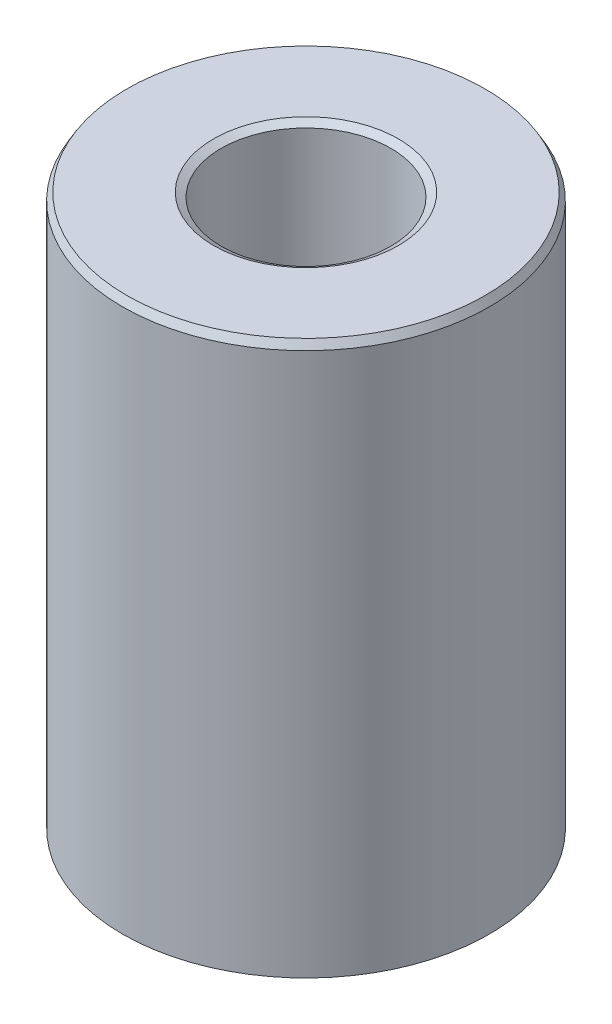
ISO-10303-21;
HEADER;
FILE_DESCRIPTION(('STEP AP214'),'2;1');
FILE_NAME('part.step','',(''),(''),'','','');
FILE_SCHEMA(('AUTOMOTIVE_DESIGN { 1 0 10303 214 1 1 1 1 }'));
ENDSEC;
DATA;
#1=APPLICATION_CONTEXT('core data for automotive mechanical design processes');
#2=APPLICATION_PROTOCOL_DEFINITION('international standard','automotive_design',2000,#1);
#3=PRODUCT_CONTEXT('',#1,'mechanical');
#4=PRODUCT('Part','Part','',(#3));
#5=PRODUCT_RELATED_PRODUCT_CATEGORY('part','',(#4));
#6=PRODUCT_DEFINITION_FORMATION('','',#4);
#7=PRODUCT_DEFINITION_CONTEXT('part definition',#1,'design');
#8=PRODUCT_DEFINITION('design','',#6,#7);
#9=PRODUCT_DEFINITION_SHAPE('','',#8);
#10=(LENGTH_UNIT() NAMED_UNIT(*) SI_UNIT(.MILLI.,.METRE.));
#11=(NAMED_UNIT(*) PLANE_ANGLE_UNIT() SI_UNIT($,.RADIAN.));
#12=(NAMED_UNIT(*) SI_UNIT($,.STERADIAN.) SOLID_ANGLE_UNIT());
#13=UNCERTAINTY_MEASURE_WITH_UNIT(LENGTH_MEASURE(1.E-05),#10,'distance_accuracy_value','');
#14=(GEOMETRIC_REPRESENTATION_CONTEXT(3) GLOBAL_UNCERTAINTY_ASSIGNED_CONTEXT((#13)) GLOBAL_UNIT_ASSIGNED_CONTEXT((#10,
#11,#12)) REPRESENTATION_CONTEXT('',''));
#15=CARTESIAN_POINT('',(0.,0.,0.));
#16=DIRECTION('',(0.,0.,1.));
#17=DIRECTION('',(1.,0.,0.));
#18=AXIS2_PLACEMENT_3D('',#15,#16,#17);
#19=CARTESIAN_POINT('',(0.,37.8354543892227,0.));
#20=DIRECTION('',(0.,-1.,0.));
#21=DIRECTION('',(0.,0.,-1.));
#22=AXIS2_PLACEMENT_3D('',#19,#20,#21);
#23=CYLINDRICAL_SURFACE('',#22,12.5);
#24=CARTESIAN_POINT('',(0.,0.298097300697332,0.));
#25=DIRECTION('',(0.,1.,0.));
#26=DIRECTION('',(0.,0.,1.));
#27=AXIS2_PLACEMENT_3D('',#24,#25,#26);
#28=CIRCLE('',#27,12.5);
#29=CARTESIAN_POINT('',(0.,0.298097300697332,12.5));
#30=VERTEX_POINT('',#29);
#31=EDGE_CURVE('E10',#30,#30,#28,.T.);
#32=ORIENTED_EDGE('',*,*,#31,.T.);
#33=EDGE_LOOP('',(#32));
#34=FACE_BOUND('',#33,.T.);
#35=CARTESIAN_POINT('',(0.,37.3191347188158,0.));
#36=DIRECTION('',(0.,1.,0.));
#37=DIRECTION('',(0.,0.,1.));
#38=AXIS2_PLACEMENT_3D('',#35,#36,#37);
#39=CIRCLE('',#38,12.5);
#40=CARTESIAN_POINT('',(0.,37.3191347188158,12.5));
#41=VERTEX_POINT('',#40);
#42=EDGE_CURVE('E50',#41,#41,#39,.F.);
#43=ORIENTED_EDGE('',*,*,#42,.T.);
#44=EDGE_LOOP('',(#43));
#45=FACE_BOUND('',#44,.T.);
#46=ADVANCED_FACE('F39',(#34,#45),#23,.T.);
#47=CARTESIAN_POINT('',(0.,37.8354543892227,0.));
#48=DIRECTION('',(0.,1.,0.));
#49=DIRECTION('',(0.,0.,1.));
#50=AXIS2_PLACEMENT_3D('',#47,#48,#49);
#51=PLANE('',#50);
#52=CARTESIAN_POINT('',(0.,37.8354543892227,0.));
#53=DIRECTION('',(0.,1.,0.));
#54=DIRECTION('',(0.,0.,1.));
#55=AXIS2_PLACEMENT_3D('',#52,#53,#54);
#56=CIRCLE('',#55,6.30006058035983);
#57=CARTESIAN_POINT('',(0.,37.8354543892227,6.30006058035983));
#58=VERTEX_POINT('',#57);
#59=EDGE_CURVE('E58',#58,#58,#56,.F.);
#60=ORIENTED_EDGE('',*,*,#59,.T.);
#61=EDGE_LOOP('',(#60));
#62=FACE_BOUND('',#61,.T.);
#63=CARTESIAN_POINT('',(0.,37.8354543892227,0.));
#64=DIRECTION('',(0.,1.,0.));
#65=DIRECTION('',(0.,0.,1.));
#66=AXIS2_PLACEMENT_3D('',#63,#64,#65);
#67=CIRCLE('',#66,12.2019026993027);
#68=CARTESIAN_POINT('',(0.,37.8354543892227,12.2019026993027));
#69=VERTEX_POINT('',#68);
#70=EDGE_CURVE('E61',#69,#69,#67,.T.);
#71=ORIENTED_EDGE('',*,*,#70,.T.);
#72=EDGE_LOOP('',(#71));
#73=FACE_BOUND('',#72,.T.);
#74=ADVANCED_FACE('F88',(#62,#73),#51,.T.);
#75=CARTESIAN_POINT('',(0.,0.,0.));
#76=DIRECTION('',(0.,1.,0.));
#77=DIRECTION('',(0.,0.,1.));
#78=AXIS2_PLACEMENT_3D('',#75,#76,#77);
#79=PLANE('',#78);
#80=CARTESIAN_POINT('',(0.,0.,0.));
#81=DIRECTION('',(0.,1.,0.));
#82=DIRECTION('',(0.,0.,1.));
#83=AXIS2_PLACEMENT_3D('',#80,#81,#82);
#84=CIRCLE('',#83,6.08183821065023);
#85=CARTESIAN_POINT('',(0.,0.,6.08183821065023));
#86=VERTEX_POINT('',#85);
#87=EDGE_CURVE('E51',#86,#86,#84,.T.);
#88=ORIENTED_EDGE('',*,*,#87,.T.);
#89=EDGE_LOOP('',(#88));
#90=FACE_BOUND('',#89,.T.);
#91=CARTESIAN_POINT('',(0.,0.,0.));
#92=DIRECTION('',(0.,1.,0.));
#93=DIRECTION('',(0.,0.,1.));
#94=AXIS2_PLACEMENT_3D('',#91,#92,#93);
#95=CIRCLE('',#94,11.9836803295931);
#96=CARTESIAN_POINT('',(0.,0.,11.9836803295931));
#97=VERTEX_POINT('',#96);
#98=EDGE_CURVE('E54',#97,#97,#95,.F.);
#99=ORIENTED_EDGE('',*,*,#98,.T.);
#100=EDGE_LOOP('',(#99));
#101=FACE_BOUND('',#100,.T.);
#102=ADVANCED_FACE('F83',(#90,#101),#79,.F.);
#103=CARTESIAN_POINT('',(0.,37.8354543892227,0.));
#104=DIRECTION('',(0.,-1.,0.));
#105=DIRECTION('',(0.,0.,-1.));
#106=AXIS2_PLACEMENT_3D('',#103,#104,#105);
#107=CYLINDRICAL_SURFACE('',#106,5.7837409099529);
#108=CARTESIAN_POINT('',(0.,37.5373570885254,0.));
#109=DIRECTION('',(0.,1.,0.));
#110=DIRECTION('',(0.,0.,1.));
#111=AXIS2_PLACEMENT_3D('',#108,#109,#110);
#112=CIRCLE('',#111,5.7837409099529);
#113=CARTESIAN_POINT('',(0.,37.5373570885254,5.7837409099529));
#114=VERTEX_POINT('',#113);
#115=EDGE_CURVE('E67',#114,#114,#112,.T.);
#116=ORIENTED_EDGE('',*,*,#115,.T.);
#117=EDGE_LOOP('',(#116));
#118=FACE_BOUND('',#117,.T.);
#119=CARTESIAN_POINT('',(0.,0.516319670406912,0.));
#120=DIRECTION('',(0.,1.,0.));
#121=DIRECTION('',(0.,0.,1.));
#122=AXIS2_PLACEMENT_3D('',#119,#120,#121);
#123=CIRCLE('',#122,5.7837409099529);
#124=CARTESIAN_POINT('',(0.,0.516319670406912,5.7837409099529));
#125=VERTEX_POINT('',#124);
#126=EDGE_CURVE('E69',#125,#125,#123,.F.);
#127=ORIENTED_EDGE('',*,*,#126,.T.);
#128=EDGE_LOOP('',(#127));
#129=FACE_BOUND('',#128,.T.);
#130=ADVANCED_FACE('F71',(#118,#129),#107,.F.);
#131=CARTESIAN_POINT('',(0.,37.5373570885254,0.));
#132=DIRECTION('',(0.,1.,0.));
#133=DIRECTION('',(0.,0.,1.));
#134=AXIS2_PLACEMENT_3D('',#131,#132,#133);
#135=CONICAL_SURFACE('',#134,5.7837409099529,1.04719755119659);
#136=ORIENTED_EDGE('',*,*,#59,.F.);
#137=EDGE_LOOP('',(#136));
#138=FACE_BOUND('',#137,.T.);
#139=ORIENTED_EDGE('',*,*,#115,.F.);
#140=EDGE_LOOP('',(#139));
#141=FACE_BOUND('',#140,.T.);
#142=ADVANCED_FACE('F77',(#138,#141),#135,.F.);
#143=CARTESIAN_POINT('',(0.,0.,0.));
#144=DIRECTION('',(0.,-1.,0.));
#145=DIRECTION('',(0.,0.,-1.));
#146=AXIS2_PLACEMENT_3D('',#143,#144,#145);
#147=CONICAL_SURFACE('',#146,6.08183821065023,0.523598775598299);
#148=ORIENTED_EDGE('',*,*,#126,.F.);
#149=EDGE_LOOP('',(#148));
#150=FACE_BOUND('',#149,.T.);
#151=ORIENTED_EDGE('',*,*,#87,.F.);
#152=EDGE_LOOP('',(#151));
#153=FACE_BOUND('',#152,.T.);
#154=ADVANCED_FACE('F73',(#150,#153),#147,.F.);
#155=CARTESIAN_POINT('',(0.,0.298097300697332,0.));
#156=DIRECTION('',(0.,1.,0.));
#157=DIRECTION('',(0.,0.,1.));
#158=AXIS2_PLACEMENT_3D('',#155,#156,#157);
#159=CONICAL_SURFACE('',#158,12.5,1.0471975511966);
#160=ORIENTED_EDGE('',*,*,#98,.F.);
#161=EDGE_LOOP('',(#160));
#162=FACE_BOUND('',#161,.T.);
#163=ORIENTED_EDGE('',*,*,#31,.F.);
#164=EDGE_LOOP('',(#163));
#165=FACE_BOUND('',#164,.T.);
#166=ADVANCED_FACE('F76',(#162,#165),#159,.T.);
#167=CARTESIAN_POINT('',(0.,37.8354543892227,0.));
#168=DIRECTION('',(0.,-1.,0.));
#169=DIRECTION('',(0.,0.,-1.));
#170=AXIS2_PLACEMENT_3D('',#167,#168,#169);
#171=CONICAL_SURFACE('',#170,12.2019026993027,0.523598775598298);
#172=ORIENTED_EDGE('',*,*,#42,.F.);
#173=EDGE_LOOP('',(#172));
#174=FACE_BOUND('',#173,.T.);
#175=ORIENTED_EDGE('',*,*,#70,.F.);
#176=EDGE_LOOP('',(#175));
#177=FACE_BOUND('',#176,.T.);
#178=ADVANCED_FACE('F45',(#174,#177),#171,.T.);
#179=CLOSED_SHELL('',(#46,#74,#102,#130,#142,#154,#166,#178));
#180=MANIFOLD_SOLID_BREP('B2',#179);
#181=ADVANCED_BREP_SHAPE_REPRESENTATION('',(#18,#180),#14);
#182=SHAPE_DEFINITION_REPRESENTATION(#9,#181);
ENDSEC;
END-ISO-10303-21;
